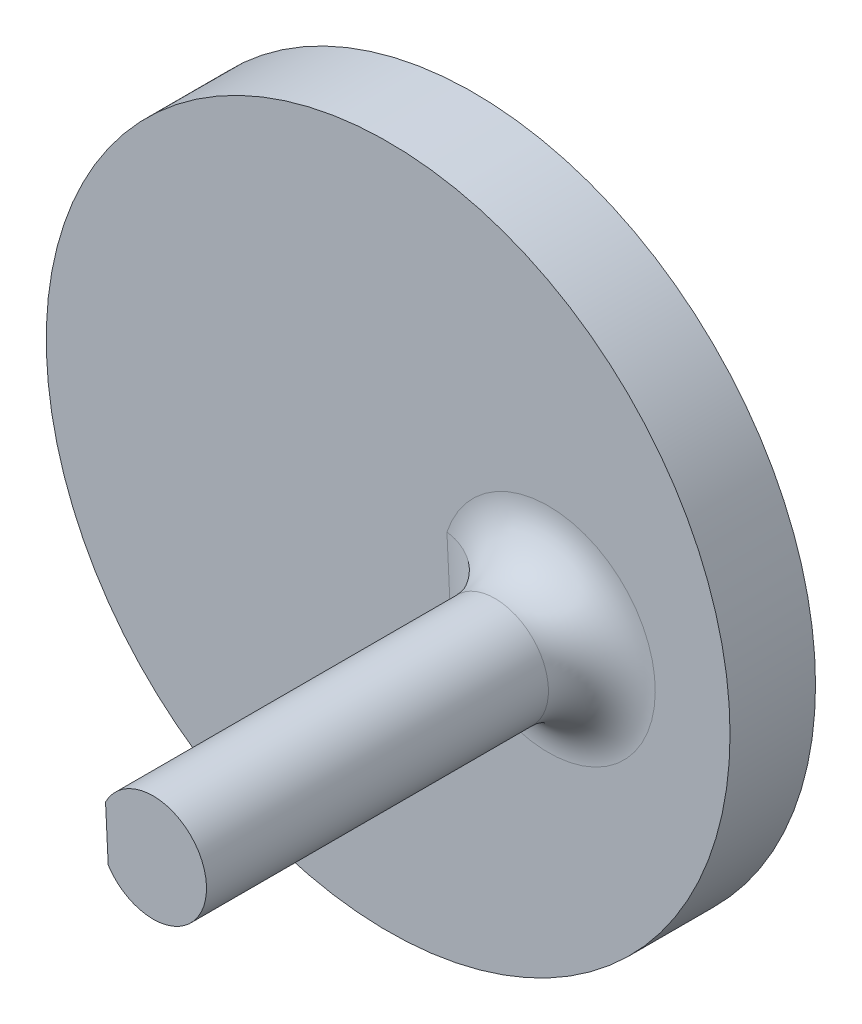
ISO-10303-21;
HEADER;
FILE_DESCRIPTION(('STEP AP214'),'2;1');
FILE_NAME('part.step','',(''),(''),'','','');
FILE_SCHEMA(('AUTOMOTIVE_DESIGN { 1 0 10303 214 1 1 1 1 }'));
ENDSEC;
DATA;
#1=APPLICATION_CONTEXT('core data for automotive mechanical design processes');
#2=APPLICATION_PROTOCOL_DEFINITION('international standard','automotive_design',2000,#1);
#3=PRODUCT_CONTEXT('',#1,'mechanical');
#4=PRODUCT('Part','Part','',(#3));
#5=PRODUCT_RELATED_PRODUCT_CATEGORY('part','',(#4));
#6=PRODUCT_DEFINITION_FORMATION('','',#4);
#7=PRODUCT_DEFINITION_CONTEXT('part definition',#1,'design');
#8=PRODUCT_DEFINITION('design','',#6,#7);
#9=PRODUCT_DEFINITION_SHAPE('','',#8);
#10=(LENGTH_UNIT() NAMED_UNIT(*) SI_UNIT(.MILLI.,.METRE.));
#11=(NAMED_UNIT(*) PLANE_ANGLE_UNIT() SI_UNIT($,.RADIAN.));
#12=(NAMED_UNIT(*) SI_UNIT($,.STERADIAN.) SOLID_ANGLE_UNIT());
#13=UNCERTAINTY_MEASURE_WITH_UNIT(LENGTH_MEASURE(1.E-05),#10,'distance_accuracy_value','');
#14=(GEOMETRIC_REPRESENTATION_CONTEXT(3) GLOBAL_UNCERTAINTY_ASSIGNED_CONTEXT((#13)) GLOBAL_UNIT_ASSIGNED_CONTEXT((#10,
#11,#12)) REPRESENTATION_CONTEXT('',''));
#15=CARTESIAN_POINT('',(0.,0.,0.));
#16=DIRECTION('',(0.,0.,1.));
#17=DIRECTION('',(1.,0.,0.));
#18=AXIS2_PLACEMENT_3D('',#15,#16,#17);
#19=CARTESIAN_POINT('',(0.,0.,5.08));
#20=DIRECTION('',(0.,0.,1.));
#21=DIRECTION('',(1.,0.,0.));
#22=AXIS2_PLACEMENT_3D('',#19,#20,#21);
#23=PLANE('',#22);
#24=CARTESIAN_POINT('',(9.525,0.,5.08));
#25=DIRECTION('',(0.,0.,1.));
#26=DIRECTION('',(1.,0.,0.));
#27=AXIS2_PLACEMENT_3D('',#24,#25,#26);
#28=CIRCLE('',#27,6.35);
#29=CARTESIAN_POINT('',(3.49338533630959,1.98547841810351,5.08));
#30=VERTEX_POINT('',#29);
#31=CARTESIAN_POINT('',(3.72221723225996,-2.57880052551943,5.08));
#32=VERTEX_POINT('',#31);
#33=EDGE_CURVE('E64',#30,#32,#28,.F.);
#34=ORIENTED_EDGE('',*,*,#33,.T.);
#35=DIRECTION('',(0.0500724974909067,-0.998745585719919,0.));
#36=VECTOR('',#35,1.);
#37=CARTESIAN_POINT('',(3.58391968036237,0.179681203870553,5.08));
#38=LINE('',#37,#36);
#39=EDGE_CURVE('E57',#32,#30,#38,.F.);
#40=ORIENTED_EDGE('',*,*,#39,.T.);
#41=EDGE_LOOP('',(#34,#40));
#42=FACE_BOUND('',#41,.T.);
#43=CARTESIAN_POINT('',(0.,0.,5.08));
#44=DIRECTION('',(0.,0.,1.));
#45=DIRECTION('',(1.,0.,0.));
#46=AXIS2_PLACEMENT_3D('',#43,#44,#45);
#47=CIRCLE('',#46,20.32);
#48=CARTESIAN_POINT('',(20.32,0.,5.08));
#49=VERTEX_POINT('',#48);
#50=EDGE_CURVE('E109',#49,#49,#47,.T.);
#51=ORIENTED_EDGE('',*,*,#50,.T.);
#52=EDGE_LOOP('',(#51));
#53=FACE_BOUND('',#52,.T.);
#54=ADVANCED_FACE('F42',(#42,#53),#23,.T.);
#55=CARTESIAN_POINT('',(0.,0.,0.));
#56=DIRECTION('',(0.,0.,1.));
#57=DIRECTION('',(1.,0.,0.));
#58=AXIS2_PLACEMENT_3D('',#55,#56,#57);
#59=PLANE('',#58);
#60=CARTESIAN_POINT('',(0.,0.,0.));
#61=DIRECTION('',(0.,0.,1.));
#62=DIRECTION('',(1.,0.,0.));
#63=AXIS2_PLACEMENT_3D('',#60,#61,#62);
#64=CIRCLE('',#63,12.7);
#65=CARTESIAN_POINT('',(12.7,0.,0.));
#66=VERTEX_POINT('',#65);
#67=EDGE_CURVE('E120',#66,#66,#64,.T.);
#68=ORIENTED_EDGE('',*,*,#67,.T.);
#69=EDGE_LOOP('',(#68));
#70=FACE_BOUND('',#69,.T.);
#71=CARTESIAN_POINT('',(0.,0.,0.));
#72=DIRECTION('',(0.,0.,1.));
#73=DIRECTION('',(1.,0.,0.));
#74=AXIS2_PLACEMENT_3D('',#71,#72,#73);
#75=CIRCLE('',#74,20.32);
#76=CARTESIAN_POINT('',(20.32,0.,0.));
#77=VERTEX_POINT('',#76);
#78=EDGE_CURVE('E105',#77,#77,#75,.T.);
#79=ORIENTED_EDGE('',*,*,#78,.F.);
#80=EDGE_LOOP('',(#79));
#81=FACE_BOUND('',#80,.T.);
#82=ADVANCED_FACE('F150',(#70,#81),#59,.F.);
#83=CARTESIAN_POINT('',(0.,0.,5.08));
#84=DIRECTION('',(0.,0.,-1.));
#85=DIRECTION('',(-1.,0.,0.));
#86=AXIS2_PLACEMENT_3D('',#83,#84,#85);
#87=CYLINDRICAL_SURFACE('',#86,20.32);
#88=ORIENTED_EDGE('',*,*,#50,.F.);
#89=EDGE_LOOP('',(#88));
#90=FACE_BOUND('',#89,.T.);
#91=ORIENTED_EDGE('',*,*,#78,.T.);
#92=EDGE_LOOP('',(#91));
#93=FACE_BOUND('',#92,.T.);
#94=ADVANCED_FACE('F147',(#90,#93),#87,.T.);
#95=CARTESIAN_POINT('',(9.525,0.,28.575));
#96=DIRECTION('',(0.,0.,-1.));
#97=DIRECTION('',(-1.,0.,0.));
#98=AXIS2_PLACEMENT_3D('',#95,#96,#97);
#99=CYLINDRICAL_SURFACE('',#98,3.175);
#100=DIRECTION('',(0.,0.,1.));
#101=VECTOR('',#100,1.);
#102=CARTESIAN_POINT('',(6.85830860871233,-1.72318949150471,1.86850067037116));
#103=LINE('',#102,#101);
#104=CARTESIAN_POINT('',(6.85830860871233,-1.72318949150471,8.255));
#105=VERTEX_POINT('',#104);
#106=CARTESIAN_POINT('',(6.85830860871233,-1.7231894915047,28.575));
#107=VERTEX_POINT('',#106);
#108=EDGE_CURVE('E94',#105,#107,#103,.T.);
#109=ORIENTED_EDGE('',*,*,#108,.F.);
#110=CARTESIAN_POINT('',(9.525,0.,8.255));
#111=DIRECTION('',(0.,0.,1.));
#112=DIRECTION('',(1.,0.,0.));
#113=AXIS2_PLACEMENT_3D('',#110,#111,#112);
#114=CIRCLE('',#113,3.175);
#115=CARTESIAN_POINT('',(6.6993284291787,1.44782774315604,8.255));
#116=VERTEX_POINT('',#115);
#117=EDGE_CURVE('E11',#105,#116,#114,.T.);
#118=ORIENTED_EDGE('',*,*,#117,.T.);
#119=DIRECTION('',(0.,0.,1.));
#120=VECTOR('',#119,1.);
#121=CARTESIAN_POINT('',(6.6993284291787,1.44782774315604,1.86850067037116));
#122=LINE('',#121,#120);
#123=CARTESIAN_POINT('',(6.6993284291787,1.44782774315604,28.575));
#124=VERTEX_POINT('',#123);
#125=EDGE_CURVE('E84',#116,#124,#122,.T.);
#126=ORIENTED_EDGE('',*,*,#125,.T.);
#127=CARTESIAN_POINT('',(9.525,0.,28.575));
#128=DIRECTION('',(0.,0.,1.));
#129=DIRECTION('',(1.,0.,0.));
#130=AXIS2_PLACEMENT_3D('',#127,#128,#129);
#131=CIRCLE('',#130,3.175);
#132=EDGE_CURVE('E89',#107,#124,#131,.T.);
#133=ORIENTED_EDGE('',*,*,#132,.F.);
#134=EDGE_LOOP('',(#109,#118,#126,#133));
#135=FACE_BOUND('',#134,.T.);
#136=ADVANCED_FACE('F87',(#135),#99,.T.);
#137=CARTESIAN_POINT('',(9.525,0.,28.575));
#138=DIRECTION('',(0.,0.,1.));
#139=DIRECTION('',(1.,0.,0.));
#140=AXIS2_PLACEMENT_3D('',#137,#138,#139);
#141=PLANE('',#140);
#142=DIRECTION('',(-0.0500724974909067,0.998745585719919,0.));
#143=VECTOR('',#142,1.);
#144=CARTESIAN_POINT('',(6.75493691502311,0.338661383404182,28.575));
#145=LINE('',#144,#143);
#146=EDGE_CURVE('E97',#107,#124,#145,.T.);
#147=ORIENTED_EDGE('',*,*,#146,.F.);
#148=ORIENTED_EDGE('',*,*,#132,.T.);
#149=EDGE_LOOP('',(#147,#148));
#150=FACE_BOUND('',#149,.T.);
#151=ADVANCED_FACE('F103',(#150),#141,.T.);
#152=CARTESIAN_POINT('',(6.75493691502311,0.338661383404182,1.86850067037116));
#153=DIRECTION('',(0.998745585719919,0.0500724974909067,0.));
#154=DIRECTION('',(-0.0500724974909067,0.998745585719919,0.));
#155=AXIS2_PLACEMENT_3D('',#152,#153,#154);
#156=PLANE('',#155);
#157=ORIENTED_EDGE('',*,*,#125,.F.);
#158=DIRECTION('',(0.0500724974909067,-0.998745585719919,0.));
#159=VECTOR('',#158,1.);
#160=CARTESIAN_POINT('',(6.75493691502311,0.338661383404182,8.255));
#161=LINE('',#160,#159);
#162=EDGE_CURVE('E124',#116,#105,#161,.T.);
#163=ORIENTED_EDGE('',*,*,#162,.T.);
#164=ORIENTED_EDGE('',*,*,#108,.T.);
#165=ORIENTED_EDGE('',*,*,#146,.T.);
#166=EDGE_LOOP('',(#157,#163,#164,#165));
#167=FACE_BOUND('',#166,.T.);
#168=ADVANCED_FACE('F98',(#167),#156,.F.);
#169=CARTESIAN_POINT('',(0.,0.,-6.35));
#170=DIRECTION('',(0.,0.,-1.));
#171=DIRECTION('',(-1.,0.,0.));
#172=AXIS2_PLACEMENT_3D('',#169,#170,#171);
#173=PLANE('',#172);
#174=CARTESIAN_POINT('',(0.,0.,-6.35));
#175=DIRECTION('',(0.,0.,-1.));
#176=DIRECTION('',(-1.,0.,0.));
#177=AXIS2_PLACEMENT_3D('',#174,#175,#176);
#178=CIRCLE('',#177,9.525);
#179=CARTESIAN_POINT('',(-9.525,0.,-6.35));
#180=VERTEX_POINT('',#179);
#181=EDGE_CURVE('E101',#180,#180,#178,.T.);
#182=ORIENTED_EDGE('',*,*,#181,.T.);
#183=EDGE_LOOP('',(#182));
#184=FACE_BOUND('',#183,.T.);
#185=CARTESIAN_POINT('',(0.,0.,-6.35));
#186=DIRECTION('',(0.,0.,-1.));
#187=DIRECTION('',(-1.,0.,0.));
#188=AXIS2_PLACEMENT_3D('',#185,#186,#187);
#189=CIRCLE('',#188,3.175);
#190=CARTESIAN_POINT('',(-3.175,0.,-6.35));
#191=VERTEX_POINT('',#190);
#192=EDGE_CURVE('E182',#191,#191,#189,.T.);
#193=ORIENTED_EDGE('',*,*,#192,.F.);
#194=EDGE_LOOP('',(#193));
#195=FACE_BOUND('',#194,.T.);
#196=ADVANCED_FACE('F163',(#184,#195),#173,.T.);
#197=CARTESIAN_POINT('',(0.,0.,-6.35));
#198=DIRECTION('',(0.,0.,1.));
#199=DIRECTION('',(1.,0.,0.));
#200=AXIS2_PLACEMENT_3D('',#197,#198,#199);
#201=CYLINDRICAL_SURFACE('',#200,9.525);
#202=CARTESIAN_POINT('',(0.,0.,-3.175));
#203=DIRECTION('',(0.,0.,1.));
#204=DIRECTION('',(1.,0.,0.));
#205=AXIS2_PLACEMENT_3D('',#202,#203,#204);
#206=CIRCLE('',#205,9.525);
#207=CARTESIAN_POINT('',(9.525,0.,-3.175));
#208=VERTEX_POINT('',#207);
#209=EDGE_CURVE('E115',#208,#208,#206,.F.);
#210=ORIENTED_EDGE('',*,*,#209,.T.);
#211=EDGE_LOOP('',(#210));
#212=FACE_BOUND('',#211,.T.);
#213=ORIENTED_EDGE('',*,*,#181,.F.);
#214=EDGE_LOOP('',(#213));
#215=FACE_BOUND('',#214,.T.);
#216=ADVANCED_FACE('F164',(#212,#215),#201,.T.);
#217=CARTESIAN_POINT('',(0.,0.,-6.35));
#218=DIRECTION('',(0.,0.,1.));
#219=DIRECTION('',(1.,0.,0.));
#220=AXIS2_PLACEMENT_3D('',#217,#218,#219);
#221=CYLINDRICAL_SURFACE('',#220,3.175);
#222=ORIENTED_EDGE('',*,*,#192,.T.);
#223=EDGE_LOOP('',(#222));
#224=FACE_BOUND('',#223,.T.);
#225=CARTESIAN_POINT('',(0.,0.,0.));
#226=DIRECTION('',(0.,0.,-1.));
#227=DIRECTION('',(-1.,0.,0.));
#228=AXIS2_PLACEMENT_3D('',#225,#226,#227);
#229=CIRCLE('',#228,3.175);
#230=CARTESIAN_POINT('',(-3.175,0.,0.));
#231=VERTEX_POINT('',#230);
#232=EDGE_CURVE('E185',#231,#231,#229,.T.);
#233=ORIENTED_EDGE('',*,*,#232,.F.);
#234=EDGE_LOOP('',(#233));
#235=FACE_BOUND('',#234,.T.);
#236=ADVANCED_FACE('F167',(#224,#235),#221,.F.);
#237=ORIENTED_EDGE('',*,*,#232,.T.);
#238=EDGE_LOOP('',(#237));
#239=FACE_BOUND('',#238,.T.);
#240=ADVANCED_FACE('F145',(#239),#59,.F.);
#241=CARTESIAN_POINT('',(0.,0.,-3.175));
#242=DIRECTION('',(0.,0.,1.));
#243=DIRECTION('',(1.,0.,0.));
#244=AXIS2_PLACEMENT_3D('',#241,#242,#243);
#245=TOROIDAL_SURFACE('',#244,12.7,3.175);
#246=ORIENTED_EDGE('',*,*,#67,.F.);
#247=EDGE_LOOP('',(#246));
#248=FACE_BOUND('',#247,.T.);
#249=ORIENTED_EDGE('',*,*,#209,.F.);
#250=EDGE_LOOP('',(#249));
#251=FACE_BOUND('',#250,.T.);
#252=ADVANCED_FACE('F140',(#248,#251),#245,.F.);
#253=CARTESIAN_POINT('',(9.525,0.,8.255));
#254=DIRECTION('',(0.,0.,1.));
#255=DIRECTION('',(1.,0.,0.));
#256=AXIS2_PLACEMENT_3D('',#253,#254,#255);
#257=TOROIDAL_SURFACE('',#256,6.35,3.175);
#258=CARTESIAN_POINT('',(6.85830860871233,-1.72318949150471,8.255));
#259=CARTESIAN_POINT('',(6.85831846763699,-1.72318264844682,8.16761752443022));
#260=CARTESIAN_POINT('',(6.854754255255,-1.72433539012777,8.08024063327727));
#261=CARTESIAN_POINT('',(6.84055402422871,-1.72890857480701,7.90613550826141));
#262=CARTESIAN_POINT('',(6.8299190362258,-1.73232868731148,7.81940718172607));
#263=CARTESIAN_POINT('',(6.80167910293279,-1.74137698569829,7.64736651836279));
#264=CARTESIAN_POINT('',(6.78408679497751,-1.74700116792282,7.56205190478893));
#265=CARTESIAN_POINT('',(6.74209639558145,-1.76035507871192,7.393306633098));
#266=CARTESIAN_POINT('',(6.71769824750185,-1.76808482479917,7.30987599066575));
#267=CARTESIAN_POINT('',(6.63455934780603,-1.79425658128822,7.0632834099187));
#268=CARTESIAN_POINT('',(6.56584849107626,-1.81568953529055,6.90366599482124));
#269=CARTESIAN_POINT('',(6.40405237456919,-1.86524788392255,6.5985576224564));
#270=CARTESIAN_POINT('',(6.31096395527048,-1.89337414601377,6.45306849967853));
#271=CARTESIAN_POINT('',(6.10122596723034,-1.95546094731747,6.17734305277369));
#272=CARTESIAN_POINT('',(5.984186265045,-1.98951648221431,6.04742456657333));
#273=CARTESIAN_POINT('',(5.73088648518204,-2.06162858418192,5.80916931716965));
#274=CARTESIAN_POINT('',(5.59461898621087,-2.09968669466328,5.70084092615974));
#275=CARTESIAN_POINT('',(5.30263958111469,-2.17947965992033,5.50584700411967));
#276=CARTESIAN_POINT('',(5.1464977272748,-2.2212866152166,5.41985515543199));
#277=CARTESIAN_POINT('',(4.82223443649224,-2.30626096814493,5.27582396732777));
#278=CARTESIAN_POINT('',(4.65412195779368,-2.34942733524186,5.21776397225692));
#279=CARTESIAN_POINT('',(4.37354779373754,-2.42004556282911,5.1469495304928));
#280=CARTESIAN_POINT('',(4.26321184551184,-2.44747260529153,5.12539181897218));
#281=CARTESIAN_POINT('',(4.04091113255055,-2.50207582959658,5.09435454948412));
#282=CARTESIAN_POINT('',(3.92894919521642,-2.52925233753469,5.08485609294438));
#283=CARTESIAN_POINT('',(3.79138268586207,-2.56227084018377,5.08066518529342));
#284=CARTESIAN_POINT('',(3.76593951409029,-2.56836205236564,5.08020327432956));
#285=CARTESIAN_POINT('',(3.73439972484074,-2.57589390542689,5.08001792180367));
#286=CARTESIAN_POINT('',(3.72830862633836,-2.57734761486058,5.08000001917903));
#287=CARTESIAN_POINT('',(3.72221723225996,-2.57880052551943,5.08));
#288=B_SPLINE_CURVE_WITH_KNOTS('',3,(#258,#259,#260,#261,#262,#263,#264,#265,#266,#267,#268,
#269,#270,#271,#272,#273,#274,#275,#276,#277,#278,#279,#280,#281,#282,#283,#284,#285,#286,#287),
.UNSPECIFIED.,.F.,.F.,(4,2,2,2,2,2,2,2,2,2,2,2,2,2,4),(0.,0.262057474239599,0.524076759163546,
0.785622280031596,1.04716997757009,1.56979982890939,2.09249745068921,2.62450526350866,
3.15671897829043,3.70349203781496,4.24986013379879,4.59646640241497,4.94252881638007,
5.02102459495073,5.03981113693992),.UNSPECIFIED.);
#289=EDGE_CURVE('E130',#32,#105,#288,.F.);
#290=ORIENTED_EDGE('',*,*,#289,.F.);
#291=ORIENTED_EDGE('',*,*,#33,.F.);
#292=CARTESIAN_POINT('',(6.6993284291787,1.44782774315604,8.255));
#293=CARTESIAN_POINT('',(6.69933892310404,1.44782192049619,8.16761752443022));
#294=CARTESIAN_POINT('',(6.69567728700208,1.44861239145949,8.08024063327727));
#295=CARTESIAN_POINT('',(6.68109085611827,1.45174234567356,7.90613550826141));
#296=CARTESIAN_POINT('',(6.67016711986542,1.45408160317188,7.81940718172607));
#297=CARTESIAN_POINT('',(6.64116379088126,1.46025998839188,7.64736651836279));
#298=CARTESIAN_POINT('',(6.62309717255807,1.46409639651043,7.56205190478893));
#299=CARTESIAN_POINT('',(6.57998168467364,1.47318349061644,7.393306633098));
#300=CARTESIAN_POINT('',(6.55493275700499,1.47843418837373,7.30987599066575));
#301=CARTESIAN_POINT('',(6.46959307551437,1.49615920581898,7.0632834099187));
#302=CARTESIAN_POINT('',(6.39908305947112,1.5106122673419,6.90366599482124));
#303=CARTESIAN_POINT('',(6.23314147631867,1.54373935922691,6.5985576224564));
#304=CARTESIAN_POINT('',(6.13770667876856,1.56241393668732,6.45306849967853));
#305=CARTESIAN_POINT('',(5.92281054111351,1.60321154132528,6.1773430527737));
#306=CARTESIAN_POINT('',(5.80295152248407,1.62539006692847,6.04742456657333));
#307=CARTESIAN_POINT('',(5.54370930977415,1.67180567721288,5.80916931716965));
#308=CARTESIAN_POINT('',(5.4043185772433,1.69604355529212,5.70084092615974));
#309=CARTESIAN_POINT('',(5.10582246354798,1.74623280128786,5.50584700411967));
#310=CARTESIAN_POINT('',(4.94628207919697,1.77221290507586,5.41985515543199));
#311=CARTESIAN_POINT('',(4.61514572854394,1.8243285426611,5.27582396732777));
#312=CARTESIAN_POINT('',(4.4435587786383,1.85046394708881,5.21776397225692));
#313=CARTESIAN_POINT('',(4.15732836578463,1.89266520727119,5.1469495304928));
#314=CARTESIAN_POINT('',(4.04480246272191,1.9089189843405,5.12539181897218));
#315=CARTESIAN_POINT('',(3.81815509872484,1.94101402259853,5.09435454948412));
#316=CARTESIAN_POINT('',(3.70403641839805,1.95685589104244,5.08485609294438));
#317=CARTESIAN_POINT('',(3.56385724779343,1.97594950625096,5.08066518529342));
#318=CARTESIAN_POINT('',(3.53793242184605,1.97946536393446,5.08020327432956));
#319=CARTESIAN_POINT('',(3.50579745797471,1.9838048585398,5.08001792180367));
#320=CARTESIAN_POINT('',(3.49959150424259,1.984642050488,5.08000001917903));
#321=CARTESIAN_POINT('',(3.49338533630959,1.98547841810351,5.08));
#322=B_SPLINE_CURVE_WITH_KNOTS('',3,(#292,#293,#294,#295,#296,#297,#298,#299,#300,#301,#302,
#303,#304,#305,#306,#307,#308,#309,#310,#311,#312,#313,#314,#315,#316,#317,#318,#319,#320,#321),
.UNSPECIFIED.,.F.,.F.,(4,2,2,2,2,2,2,2,2,2,2,2,2,2,4),(0.,0.262057474239599,0.524076759163547,
0.785622280031596,1.04716997757009,1.56979982890939,2.09249745068921,2.62450526350866,
3.15671897829043,3.70349203781496,4.24986013379879,4.59646640241497,4.94252881638007,
5.02102459495073,5.03981113693992),.UNSPECIFIED.);
#323=EDGE_CURVE('E47',#116,#30,#322,.T.);
#324=ORIENTED_EDGE('',*,*,#323,.F.);
#325=ORIENTED_EDGE('',*,*,#117,.F.);
#326=EDGE_LOOP('',(#290,#291,#324,#325));
#327=FACE_BOUND('',#326,.T.);
#328=ADVANCED_FACE('F136',(#327),#257,.F.);
#329=CARTESIAN_POINT('',(3.58391968036237,0.179681203870553,8.255));
#330=DIRECTION('',(0.0500724974909067,-0.998745585719919,0.));
#331=DIRECTION('',(0.998745585719919,0.0500724974909067,0.));
#332=AXIS2_PLACEMENT_3D('',#329,#330,#331);
#333=CYLINDRICAL_SURFACE('',#332,3.175);
#334=ORIENTED_EDGE('',*,*,#323,.T.);
#335=ORIENTED_EDGE('',*,*,#39,.F.);
#336=ORIENTED_EDGE('',*,*,#289,.T.);
#337=ORIENTED_EDGE('',*,*,#162,.F.);
#338=EDGE_LOOP('',(#334,#335,#336,#337));
#339=FACE_BOUND('',#338,.T.);
#340=ADVANCED_FACE('F44',(#339),#333,.F.);
#341=CLOSED_SHELL('',(#54,#82,#94,#136,#151,#168,#196,#216,#236,#240,#252,#328,#340));
#342=MANIFOLD_SOLID_BREP('B2',#341);
#343=ADVANCED_BREP_SHAPE_REPRESENTATION('',(#18,#342),#14);
#344=SHAPE_DEFINITION_REPRESENTATION(#9,#343);
ENDSEC;
END-ISO-10303-21;
